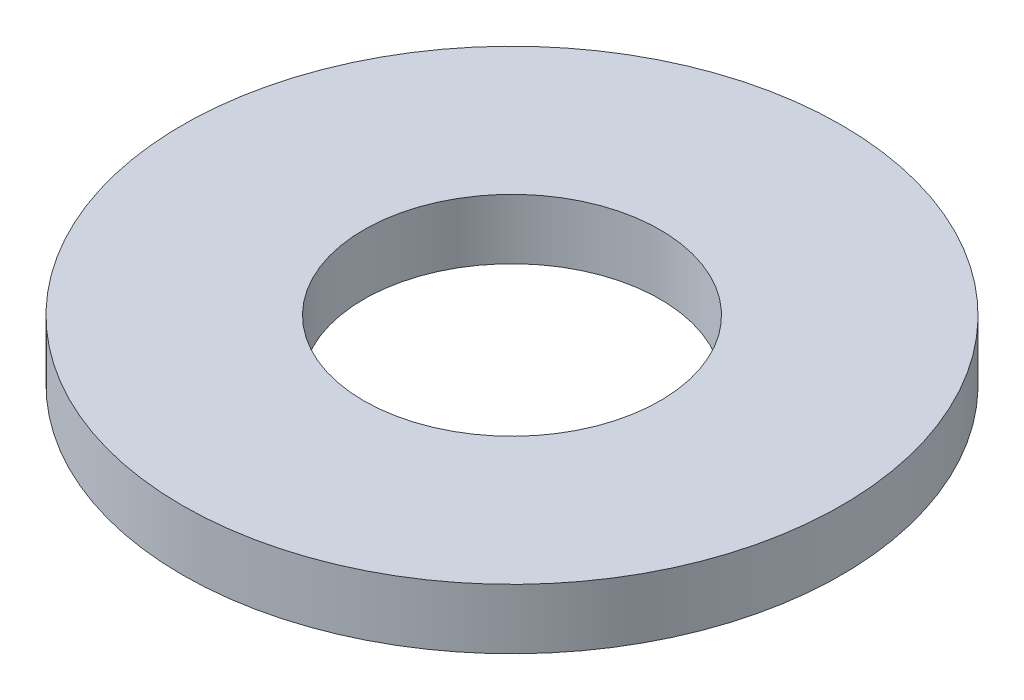
ISO-10303-21;
HEADER;
FILE_DESCRIPTION(('STEP AP214'),'2;1');
FILE_NAME('part.step','',(''),(''),'','','');
FILE_SCHEMA(('AUTOMOTIVE_DESIGN { 1 0 10303 214 1 1 1 1 }'));
ENDSEC;
DATA;
#1=APPLICATION_CONTEXT('core data for automotive mechanical design processes');
#2=APPLICATION_PROTOCOL_DEFINITION('international standard','automotive_design',2000,#1);
#3=PRODUCT_CONTEXT('',#1,'mechanical');
#4=PRODUCT('Part','Part','',(#3));
#5=PRODUCT_RELATED_PRODUCT_CATEGORY('part','',(#4));
#6=PRODUCT_DEFINITION_FORMATION('','',#4);
#7=PRODUCT_DEFINITION_CONTEXT('part definition',#1,'design');
#8=PRODUCT_DEFINITION('design','',#6,#7);
#9=PRODUCT_DEFINITION_SHAPE('','',#8);
#10=(LENGTH_UNIT() NAMED_UNIT(*) SI_UNIT(.MILLI.,.METRE.));
#11=(NAMED_UNIT(*) PLANE_ANGLE_UNIT() SI_UNIT($,.RADIAN.));
#12=(NAMED_UNIT(*) SI_UNIT($,.STERADIAN.) SOLID_ANGLE_UNIT());
#13=UNCERTAINTY_MEASURE_WITH_UNIT(LENGTH_MEASURE(1.E-05),#10,'distance_accuracy_value','');
#14=(GEOMETRIC_REPRESENTATION_CONTEXT(3) GLOBAL_UNCERTAINTY_ASSIGNED_CONTEXT((#13)) GLOBAL_UNIT_ASSIGNED_CONTEXT((#10,
#11,#12)) REPRESENTATION_CONTEXT('',''));
#15=CARTESIAN_POINT('',(0.,0.,0.));
#16=DIRECTION('',(0.,0.,1.));
#17=DIRECTION('',(1.,0.,0.));
#18=AXIS2_PLACEMENT_3D('',#15,#16,#17);
#19=CARTESIAN_POINT('',(0.,1.4478,0.));
#20=DIRECTION('',(0.,-1.,0.));
#21=DIRECTION('',(0.,0.,-1.));
#22=AXIS2_PLACEMENT_3D('',#19,#20,#21);
#23=CYLINDRICAL_SURFACE('',#22,7.9375);
#24=CARTESIAN_POINT('',(0.,1.4478,0.));
#25=DIRECTION('',(0.,1.,0.));
#26=DIRECTION('',(0.,0.,1.));
#27=AXIS2_PLACEMENT_3D('',#24,#25,#26);
#28=CIRCLE('',#27,7.9375);
#29=CARTESIAN_POINT('',(0.,1.4478,7.9375));
#30=VERTEX_POINT('',#29);
#31=EDGE_CURVE('E10',#30,#30,#28,.T.);
#32=ORIENTED_EDGE('',*,*,#31,.F.);
#33=EDGE_LOOP('',(#32));
#34=FACE_BOUND('',#33,.T.);
#35=CARTESIAN_POINT('',(0.,0.,0.));
#36=DIRECTION('',(0.,1.,0.));
#37=DIRECTION('',(0.,0.,1.));
#38=AXIS2_PLACEMENT_3D('',#35,#36,#37);
#39=CIRCLE('',#38,7.9375);
#40=CARTESIAN_POINT('',(0.,0.,7.9375));
#41=VERTEX_POINT('',#40);
#42=EDGE_CURVE('E31',#41,#41,#39,.T.);
#43=ORIENTED_EDGE('',*,*,#42,.T.);
#44=EDGE_LOOP('',(#43));
#45=FACE_BOUND('',#44,.T.);
#46=ADVANCED_FACE('F28',(#34,#45),#23,.T.);
#47=CARTESIAN_POINT('',(0.,1.4478,0.));
#48=DIRECTION('',(0.,1.,0.));
#49=DIRECTION('',(0.,0.,1.));
#50=AXIS2_PLACEMENT_3D('',#47,#48,#49);
#51=PLANE('',#50);
#52=CARTESIAN_POINT('',(0.,1.4478,0.));
#53=DIRECTION('',(0.,1.,0.));
#54=DIRECTION('',(0.,0.,1.));
#55=AXIS2_PLACEMENT_3D('',#52,#53,#54);
#56=CIRCLE('',#55,3.5687);
#57=CARTESIAN_POINT('',(0.,1.4478,3.5687));
#58=VERTEX_POINT('',#57);
#59=EDGE_CURVE('E40',#58,#58,#56,.T.);
#60=ORIENTED_EDGE('',*,*,#59,.F.);
#61=EDGE_LOOP('',(#60));
#62=FACE_BOUND('',#61,.T.);
#63=ORIENTED_EDGE('',*,*,#31,.T.);
#64=EDGE_LOOP('',(#63));
#65=FACE_BOUND('',#64,.T.);
#66=ADVANCED_FACE('F55',(#62,#65),#51,.T.);
#67=CARTESIAN_POINT('',(0.,0.,0.));
#68=DIRECTION('',(0.,1.,0.));
#69=DIRECTION('',(0.,0.,1.));
#70=AXIS2_PLACEMENT_3D('',#67,#68,#69);
#71=PLANE('',#70);
#72=CARTESIAN_POINT('',(0.,0.,0.));
#73=DIRECTION('',(0.,1.,0.));
#74=DIRECTION('',(0.,0.,1.));
#75=AXIS2_PLACEMENT_3D('',#72,#73,#74);
#76=CIRCLE('',#75,3.5687);
#77=CARTESIAN_POINT('',(0.,0.,3.5687));
#78=VERTEX_POINT('',#77);
#79=EDGE_CURVE('E38',#78,#78,#76,.T.);
#80=ORIENTED_EDGE('',*,*,#79,.T.);
#81=EDGE_LOOP('',(#80));
#82=FACE_BOUND('',#81,.T.);
#83=ORIENTED_EDGE('',*,*,#42,.F.);
#84=EDGE_LOOP('',(#83));
#85=FACE_BOUND('',#84,.T.);
#86=ADVANCED_FACE('F46',(#82,#85),#71,.F.);
#87=CARTESIAN_POINT('',(0.,0.,0.));
#88=DIRECTION('',(0.,1.,0.));
#89=DIRECTION('',(0.,0.,1.));
#90=AXIS2_PLACEMENT_3D('',#87,#88,#89);
#91=CYLINDRICAL_SURFACE('',#90,3.5687);
#92=ORIENTED_EDGE('',*,*,#79,.F.);
#93=EDGE_LOOP('',(#92));
#94=FACE_BOUND('',#93,.T.);
#95=ORIENTED_EDGE('',*,*,#59,.T.);
#96=EDGE_LOOP('',(#95));
#97=FACE_BOUND('',#96,.T.);
#98=ADVANCED_FACE('F49',(#94,#97),#91,.F.);
#99=CLOSED_SHELL('',(#46,#66,#86,#98));
#100=MANIFOLD_SOLID_BREP('B2',#99);
#101=ADVANCED_BREP_SHAPE_REPRESENTATION('',(#18,#100),#14);
#102=SHAPE_DEFINITION_REPRESENTATION(#9,#101);
ENDSEC;
END-ISO-10303-21;
